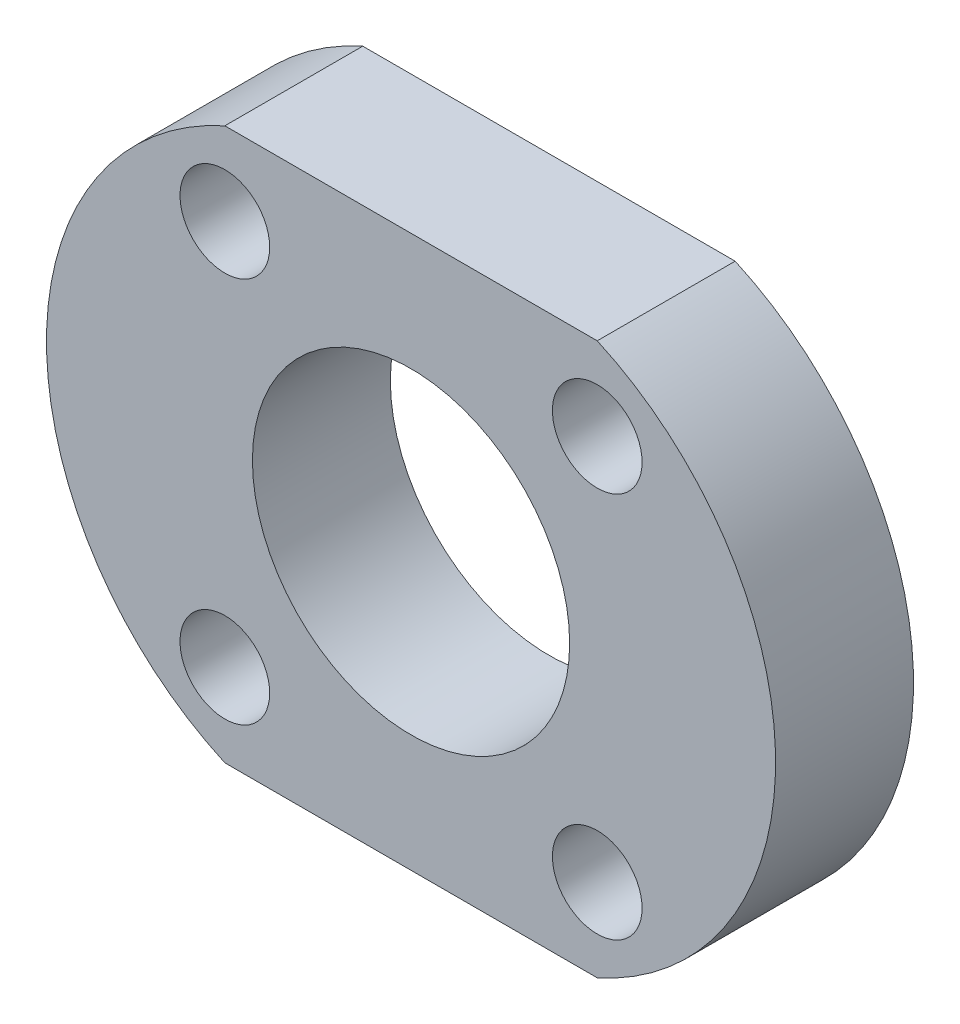
ISO-10303-21;
HEADER;
FILE_DESCRIPTION(('STEP AP214'),'2;1');
FILE_NAME('part.step','',(''),(''),'','','');
FILE_SCHEMA(('AUTOMOTIVE_DESIGN { 1 0 10303 214 1 1 1 1 }'));
ENDSEC;
DATA;
#1=APPLICATION_CONTEXT('core data for automotive mechanical design processes');
#2=APPLICATION_PROTOCOL_DEFINITION('international standard','automotive_design',2000,#1);
#3=PRODUCT_CONTEXT('',#1,'mechanical');
#4=PRODUCT('Part','Part','',(#3));
#5=PRODUCT_RELATED_PRODUCT_CATEGORY('part','',(#4));
#6=PRODUCT_DEFINITION_FORMATION('','',#4);
#7=PRODUCT_DEFINITION_CONTEXT('part definition',#1,'design');
#8=PRODUCT_DEFINITION('design','',#6,#7);
#9=PRODUCT_DEFINITION_SHAPE('','',#8);
#10=(LENGTH_UNIT() NAMED_UNIT(*) SI_UNIT(.MILLI.,.METRE.));
#11=(NAMED_UNIT(*) PLANE_ANGLE_UNIT() SI_UNIT($,.RADIAN.));
#12=(NAMED_UNIT(*) SI_UNIT($,.STERADIAN.) SOLID_ANGLE_UNIT());
#13=UNCERTAINTY_MEASURE_WITH_UNIT(LENGTH_MEASURE(1.E-05),#10,'distance_accuracy_value','');
#14=(GEOMETRIC_REPRESENTATION_CONTEXT(3) GLOBAL_UNCERTAINTY_ASSIGNED_CONTEXT((#13)) GLOBAL_UNIT_ASSIGNED_CONTEXT((#10,
#11,#12)) REPRESENTATION_CONTEXT('',''));
#15=CARTESIAN_POINT('',(0.,0.,0.));
#16=DIRECTION('',(0.,0.,1.));
#17=DIRECTION('',(1.,0.,0.));
#18=AXIS2_PLACEMENT_3D('',#15,#16,#17);
#19=CARTESIAN_POINT('',(4.5,0.,10.));
#20=DIRECTION('',(0.,0.,-1.));
#21=DIRECTION('',(-1.,0.,0.));
#22=AXIS2_PLACEMENT_3D('',#19,#20,#21);
#23=CYLINDRICAL_SURFACE('',#22,21.9317121994613);
#24=CARTESIAN_POINT('',(4.5,0.,0.));
#25=DIRECTION('',(0.,0.,1.));
#26=DIRECTION('',(-1.,0.,0.));
#27=AXIS2_PLACEMENT_3D('',#24,#25,#26);
#28=CIRCLE('',#27,21.9317121994613);
#29=CARTESIAN_POINT('',(13.5,-20.,0.));
#30=VERTEX_POINT('',#29);
#31=CARTESIAN_POINT('',(13.5,20.,0.));
#32=VERTEX_POINT('',#31);
#33=EDGE_CURVE('E112',#30,#32,#28,.T.);
#34=ORIENTED_EDGE('',*,*,#33,.T.);
#35=DIRECTION('',(0.,0.,-1.));
#36=VECTOR('',#35,1.);
#37=CARTESIAN_POINT('',(13.5,20.,10.));
#38=LINE('',#37,#36);
#39=CARTESIAN_POINT('',(13.5,20.,10.));
#40=VERTEX_POINT('',#39);
#41=EDGE_CURVE('E11',#40,#32,#38,.T.);
#42=ORIENTED_EDGE('',*,*,#41,.F.);
#43=CARTESIAN_POINT('',(4.5,0.,10.));
#44=DIRECTION('',(0.,0.,1.));
#45=DIRECTION('',(-1.,0.,0.));
#46=AXIS2_PLACEMENT_3D('',#43,#44,#45);
#47=CIRCLE('',#46,21.9317121994613);
#48=CARTESIAN_POINT('',(13.5,-20.,10.));
#49=VERTEX_POINT('',#48);
#50=EDGE_CURVE('E96',#49,#40,#47,.T.);
#51=ORIENTED_EDGE('',*,*,#50,.F.);
#52=DIRECTION('',(0.,0.,-1.));
#53=VECTOR('',#52,1.);
#54=CARTESIAN_POINT('',(13.5,-20.,10.));
#55=LINE('',#54,#53);
#56=EDGE_CURVE('E108',#49,#30,#55,.T.);
#57=ORIENTED_EDGE('',*,*,#56,.T.);
#58=EDGE_LOOP('',(#34,#42,#51,#57));
#59=FACE_BOUND('',#58,.T.);
#60=ADVANCED_FACE('F44',(#59),#23,.T.);
#61=CARTESIAN_POINT('',(-13.5,20.,10.));
#62=DIRECTION('',(0.,-1.,0.));
#63=DIRECTION('',(0.,0.,-1.));
#64=AXIS2_PLACEMENT_3D('',#61,#62,#63);
#65=PLANE('',#64);
#66=DIRECTION('',(-1.,0.,0.));
#67=VECTOR('',#66,1.);
#68=CARTESIAN_POINT('',(-13.5,20.,0.));
#69=LINE('',#68,#67);
#70=CARTESIAN_POINT('',(-13.5,20.,0.));
#71=VERTEX_POINT('',#70);
#72=EDGE_CURVE('E101',#32,#71,#69,.T.);
#73=ORIENTED_EDGE('',*,*,#72,.T.);
#74=DIRECTION('',(0.,0.,-1.));
#75=VECTOR('',#74,1.);
#76=CARTESIAN_POINT('',(-13.5,20.,10.));
#77=LINE('',#76,#75);
#78=CARTESIAN_POINT('',(-13.5,20.,10.));
#79=VERTEX_POINT('',#78);
#80=EDGE_CURVE('E53',#79,#71,#77,.T.);
#81=ORIENTED_EDGE('',*,*,#80,.F.);
#82=DIRECTION('',(-1.,0.,0.));
#83=VECTOR('',#82,1.);
#84=CARTESIAN_POINT('',(-13.5,20.,10.));
#85=LINE('',#84,#83);
#86=EDGE_CURVE('E91',#40,#79,#85,.T.);
#87=ORIENTED_EDGE('',*,*,#86,.F.);
#88=ORIENTED_EDGE('',*,*,#41,.T.);
#89=EDGE_LOOP('',(#73,#81,#87,#88));
#90=FACE_BOUND('',#89,.T.);
#91=ADVANCED_FACE('F100',(#90),#65,.F.);
#92=CARTESIAN_POINT('',(-4.5,0.,10.));
#93=DIRECTION('',(0.,0.,-1.));
#94=DIRECTION('',(-1.,0.,0.));
#95=AXIS2_PLACEMENT_3D('',#92,#93,#94);
#96=CYLINDRICAL_SURFACE('',#95,21.9317121994613);
#97=CARTESIAN_POINT('',(-4.5,0.,0.));
#98=DIRECTION('',(0.,0.,1.));
#99=DIRECTION('',(1.,0.,0.));
#100=AXIS2_PLACEMENT_3D('',#97,#98,#99);
#101=CIRCLE('',#100,21.9317121994613);
#102=CARTESIAN_POINT('',(-13.5,-20.,0.));
#103=VERTEX_POINT('',#102);
#104=EDGE_CURVE('E78',#71,#103,#101,.T.);
#105=ORIENTED_EDGE('',*,*,#104,.T.);
#106=DIRECTION('',(0.,0.,-1.));
#107=VECTOR('',#106,1.);
#108=CARTESIAN_POINT('',(-13.5,-20.,10.));
#109=LINE('',#108,#107);
#110=CARTESIAN_POINT('',(-13.5,-20.,10.));
#111=VERTEX_POINT('',#110);
#112=EDGE_CURVE('E103',#111,#103,#109,.T.);
#113=ORIENTED_EDGE('',*,*,#112,.F.);
#114=CARTESIAN_POINT('',(-4.5,0.,10.));
#115=DIRECTION('',(0.,0.,1.));
#116=DIRECTION('',(1.,0.,0.));
#117=AXIS2_PLACEMENT_3D('',#114,#115,#116);
#118=CIRCLE('',#117,21.9317121994613);
#119=EDGE_CURVE('E94',#79,#111,#118,.T.);
#120=ORIENTED_EDGE('',*,*,#119,.F.);
#121=ORIENTED_EDGE('',*,*,#80,.T.);
#122=EDGE_LOOP('',(#105,#113,#120,#121));
#123=FACE_BOUND('',#122,.T.);
#124=ADVANCED_FACE('F104',(#123),#96,.T.);
#125=CARTESIAN_POINT('',(-13.5,-20.,10.));
#126=DIRECTION('',(0.,1.,0.));
#127=DIRECTION('',(0.,0.,1.));
#128=AXIS2_PLACEMENT_3D('',#125,#126,#127);
#129=PLANE('',#128);
#130=DIRECTION('',(1.,0.,0.));
#131=VECTOR('',#130,1.);
#132=CARTESIAN_POINT('',(-13.5,-20.,0.));
#133=LINE('',#132,#131);
#134=EDGE_CURVE('E84',#103,#30,#133,.T.);
#135=ORIENTED_EDGE('',*,*,#134,.T.);
#136=ORIENTED_EDGE('',*,*,#56,.F.);
#137=DIRECTION('',(1.,0.,0.));
#138=VECTOR('',#137,1.);
#139=CARTESIAN_POINT('',(-13.5,-20.,10.));
#140=LINE('',#139,#138);
#141=EDGE_CURVE('E61',#111,#49,#140,.T.);
#142=ORIENTED_EDGE('',*,*,#141,.F.);
#143=ORIENTED_EDGE('',*,*,#112,.T.);
#144=EDGE_LOOP('',(#135,#136,#142,#143));
#145=FACE_BOUND('',#144,.T.);
#146=ADVANCED_FACE('F126',(#145),#129,.F.);
#147=CARTESIAN_POINT('',(4.5,0.,10.));
#148=DIRECTION('',(0.,0.,-1.));
#149=DIRECTION('',(-1.,0.,0.));
#150=AXIS2_PLACEMENT_3D('',#147,#148,#149);
#151=PLANE('',#150);
#152=CARTESIAN_POINT('',(13.5,14.,10.));
#153=DIRECTION('',(0.,0.,1.));
#154=DIRECTION('',(1.,0.,0.));
#155=AXIS2_PLACEMENT_3D('',#152,#153,#154);
#156=CIRCLE('',#155,3.25);
#157=CARTESIAN_POINT('',(16.75,14.,10.));
#158=VERTEX_POINT('',#157);
#159=EDGE_CURVE('E153',#158,#158,#156,.T.);
#160=ORIENTED_EDGE('',*,*,#159,.F.);
#161=EDGE_LOOP('',(#160));
#162=FACE_BOUND('',#161,.T.);
#163=CARTESIAN_POINT('',(13.5,-14.,10.));
#164=DIRECTION('',(0.,0.,1.));
#165=DIRECTION('',(1.,0.,0.));
#166=AXIS2_PLACEMENT_3D('',#163,#164,#165);
#167=CIRCLE('',#166,3.25);
#168=CARTESIAN_POINT('',(16.75,-14.,10.));
#169=VERTEX_POINT('',#168);
#170=EDGE_CURVE('E161',#169,#169,#167,.T.);
#171=ORIENTED_EDGE('',*,*,#170,.F.);
#172=EDGE_LOOP('',(#171));
#173=FACE_BOUND('',#172,.T.);
#174=CARTESIAN_POINT('',(-13.5,-14.,10.));
#175=DIRECTION('',(0.,0.,1.));
#176=DIRECTION('',(1.,0.,0.));
#177=AXIS2_PLACEMENT_3D('',#174,#175,#176);
#178=CIRCLE('',#177,3.25);
#179=CARTESIAN_POINT('',(-10.25,-14.,10.));
#180=VERTEX_POINT('',#179);
#181=EDGE_CURVE('E145',#180,#180,#178,.T.);
#182=ORIENTED_EDGE('',*,*,#181,.F.);
#183=EDGE_LOOP('',(#182));
#184=FACE_BOUND('',#183,.T.);
#185=CARTESIAN_POINT('',(-13.5,14.,10.));
#186=DIRECTION('',(0.,0.,1.));
#187=DIRECTION('',(1.,0.,0.));
#188=AXIS2_PLACEMENT_3D('',#185,#186,#187);
#189=CIRCLE('',#188,3.25);
#190=CARTESIAN_POINT('',(-10.25,14.,10.));
#191=VERTEX_POINT('',#190);
#192=EDGE_CURVE('E141',#191,#191,#189,.T.);
#193=ORIENTED_EDGE('',*,*,#192,.F.);
#194=EDGE_LOOP('',(#193));
#195=FACE_BOUND('',#194,.T.);
#196=CARTESIAN_POINT('',(0.,0.,10.));
#197=DIRECTION('',(0.,0.,1.));
#198=DIRECTION('',(1.,0.,0.));
#199=AXIS2_PLACEMENT_3D('',#196,#197,#198);
#200=CIRCLE('',#199,11.5);
#201=CARTESIAN_POINT('',(11.5,0.,10.));
#202=VERTEX_POINT('',#201);
#203=EDGE_CURVE('E133',#202,#202,#200,.T.);
#204=ORIENTED_EDGE('',*,*,#203,.F.);
#205=EDGE_LOOP('',(#204));
#206=FACE_BOUND('',#205,.T.);
#207=ORIENTED_EDGE('',*,*,#50,.T.);
#208=ORIENTED_EDGE('',*,*,#86,.T.);
#209=ORIENTED_EDGE('',*,*,#119,.T.);
#210=ORIENTED_EDGE('',*,*,#141,.T.);
#211=EDGE_LOOP('',(#207,#208,#209,#210));
#212=FACE_BOUND('',#211,.T.);
#213=ADVANCED_FACE('F92',(#162,#173,#184,#195,#206,#212),#151,.F.);
#214=CARTESIAN_POINT('',(4.5,0.,0.));
#215=DIRECTION('',(0.,0.,-1.));
#216=DIRECTION('',(-1.,0.,0.));
#217=AXIS2_PLACEMENT_3D('',#214,#215,#216);
#218=PLANE('',#217);
#219=CARTESIAN_POINT('',(13.5,14.,0.));
#220=DIRECTION('',(0.,0.,1.));
#221=DIRECTION('',(1.,0.,0.));
#222=AXIS2_PLACEMENT_3D('',#219,#220,#221);
#223=CIRCLE('',#222,3.25);
#224=CARTESIAN_POINT('',(16.75,14.,0.));
#225=VERTEX_POINT('',#224);
#226=EDGE_CURVE('E149',#225,#225,#223,.T.);
#227=ORIENTED_EDGE('',*,*,#226,.T.);
#228=EDGE_LOOP('',(#227));
#229=FACE_BOUND('',#228,.T.);
#230=CARTESIAN_POINT('',(13.5,-14.,0.));
#231=DIRECTION('',(0.,0.,1.));
#232=DIRECTION('',(1.,0.,0.));
#233=AXIS2_PLACEMENT_3D('',#230,#231,#232);
#234=CIRCLE('',#233,3.25);
#235=CARTESIAN_POINT('',(16.75,-14.,0.));
#236=VERTEX_POINT('',#235);
#237=EDGE_CURVE('E157',#236,#236,#234,.T.);
#238=ORIENTED_EDGE('',*,*,#237,.T.);
#239=EDGE_LOOP('',(#238));
#240=FACE_BOUND('',#239,.T.);
#241=CARTESIAN_POINT('',(-13.5,-14.,0.));
#242=DIRECTION('',(0.,0.,1.));
#243=DIRECTION('',(1.,0.,0.));
#244=AXIS2_PLACEMENT_3D('',#241,#242,#243);
#245=CIRCLE('',#244,3.25);
#246=CARTESIAN_POINT('',(-10.25,-14.,0.));
#247=VERTEX_POINT('',#246);
#248=EDGE_CURVE('E165',#247,#247,#245,.T.);
#249=ORIENTED_EDGE('',*,*,#248,.T.);
#250=EDGE_LOOP('',(#249));
#251=FACE_BOUND('',#250,.T.);
#252=CARTESIAN_POINT('',(-13.5,14.,0.));
#253=DIRECTION('',(0.,0.,1.));
#254=DIRECTION('',(1.,0.,0.));
#255=AXIS2_PLACEMENT_3D('',#252,#253,#254);
#256=CIRCLE('',#255,3.25);
#257=CARTESIAN_POINT('',(-10.25,14.,0.));
#258=VERTEX_POINT('',#257);
#259=EDGE_CURVE('E137',#258,#258,#256,.T.);
#260=ORIENTED_EDGE('',*,*,#259,.T.);
#261=EDGE_LOOP('',(#260));
#262=FACE_BOUND('',#261,.T.);
#263=CARTESIAN_POINT('',(0.,0.,0.));
#264=DIRECTION('',(0.,0.,1.));
#265=DIRECTION('',(1.,0.,0.));
#266=AXIS2_PLACEMENT_3D('',#263,#264,#265);
#267=CIRCLE('',#266,11.5);
#268=CARTESIAN_POINT('',(11.5,0.,0.));
#269=VERTEX_POINT('',#268);
#270=EDGE_CURVE('E116',#269,#269,#267,.T.);
#271=ORIENTED_EDGE('',*,*,#270,.T.);
#272=EDGE_LOOP('',(#271));
#273=FACE_BOUND('',#272,.T.);
#274=ORIENTED_EDGE('',*,*,#33,.F.);
#275=ORIENTED_EDGE('',*,*,#134,.F.);
#276=ORIENTED_EDGE('',*,*,#104,.F.);
#277=ORIENTED_EDGE('',*,*,#72,.F.);
#278=EDGE_LOOP('',(#274,#275,#276,#277));
#279=FACE_BOUND('',#278,.T.);
#280=ADVANCED_FACE('F129',(#229,#240,#251,#262,#273,#279),#218,.T.);
#281=CARTESIAN_POINT('',(0.,0.,0.));
#282=DIRECTION('',(0.,0.,1.));
#283=DIRECTION('',(1.,0.,0.));
#284=AXIS2_PLACEMENT_3D('',#281,#282,#283);
#285=CYLINDRICAL_SURFACE('',#284,11.5);
#286=ORIENTED_EDGE('',*,*,#270,.F.);
#287=EDGE_LOOP('',(#286));
#288=FACE_BOUND('',#287,.T.);
#289=ORIENTED_EDGE('',*,*,#203,.T.);
#290=EDGE_LOOP('',(#289));
#291=FACE_BOUND('',#290,.T.);
#292=ADVANCED_FACE('F183',(#288,#291),#285,.F.);
#293=CARTESIAN_POINT('',(-13.5,14.,0.));
#294=DIRECTION('',(0.,0.,1.));
#295=DIRECTION('',(1.,0.,0.));
#296=AXIS2_PLACEMENT_3D('',#293,#294,#295);
#297=CYLINDRICAL_SURFACE('',#296,3.25);
#298=ORIENTED_EDGE('',*,*,#259,.F.);
#299=EDGE_LOOP('',(#298));
#300=FACE_BOUND('',#299,.T.);
#301=ORIENTED_EDGE('',*,*,#192,.T.);
#302=EDGE_LOOP('',(#301));
#303=FACE_BOUND('',#302,.T.);
#304=ADVANCED_FACE('F185',(#300,#303),#297,.F.);
#305=CARTESIAN_POINT('',(-13.5,-14.,0.));
#306=DIRECTION('',(0.,0.,1.));
#307=DIRECTION('',(1.,0.,0.));
#308=AXIS2_PLACEMENT_3D('',#305,#306,#307);
#309=CYLINDRICAL_SURFACE('',#308,3.25);
#310=ORIENTED_EDGE('',*,*,#248,.F.);
#311=EDGE_LOOP('',(#310));
#312=FACE_BOUND('',#311,.T.);
#313=ORIENTED_EDGE('',*,*,#181,.T.);
#314=EDGE_LOOP('',(#313));
#315=FACE_BOUND('',#314,.T.);
#316=ADVANCED_FACE('F173',(#312,#315),#309,.F.);
#317=CARTESIAN_POINT('',(13.5,-14.,0.));
#318=DIRECTION('',(0.,0.,1.));
#319=DIRECTION('',(1.,0.,0.));
#320=AXIS2_PLACEMENT_3D('',#317,#318,#319);
#321=CYLINDRICAL_SURFACE('',#320,3.25);
#322=ORIENTED_EDGE('',*,*,#237,.F.);
#323=EDGE_LOOP('',(#322));
#324=FACE_BOUND('',#323,.T.);
#325=ORIENTED_EDGE('',*,*,#170,.T.);
#326=EDGE_LOOP('',(#325));
#327=FACE_BOUND('',#326,.T.);
#328=ADVANCED_FACE('F251',(#324,#327),#321,.F.);
#329=CARTESIAN_POINT('',(13.5,14.,0.));
#330=DIRECTION('',(0.,0.,1.));
#331=DIRECTION('',(1.,0.,0.));
#332=AXIS2_PLACEMENT_3D('',#329,#330,#331);
#333=CYLINDRICAL_SURFACE('',#332,3.25);
#334=ORIENTED_EDGE('',*,*,#226,.F.);
#335=EDGE_LOOP('',(#334));
#336=FACE_BOUND('',#335,.T.);
#337=ORIENTED_EDGE('',*,*,#159,.T.);
#338=EDGE_LOOP('',(#337));
#339=FACE_BOUND('',#338,.T.);
#340=ADVANCED_FACE('F260',(#336,#339),#333,.F.);
#341=CLOSED_SHELL('',(#60,#91,#124,#146,#213,#280,#292,#304,#316,#328,#340));
#342=MANIFOLD_SOLID_BREP('B2',#341);
#343=ADVANCED_BREP_SHAPE_REPRESENTATION('',(#18,#342),#14);
#344=SHAPE_DEFINITION_REPRESENTATION(#9,#343);
ENDSEC;
END-ISO-10303-21;
